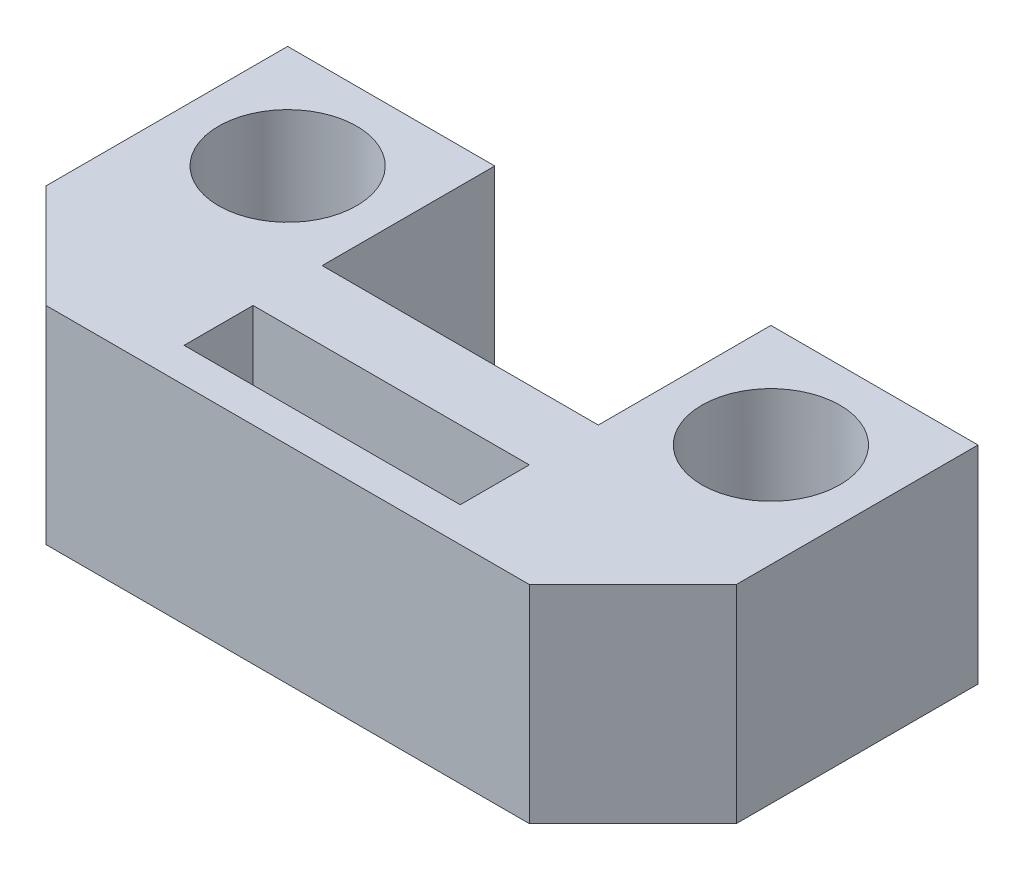
ISO-10303-21;
HEADER;
FILE_DESCRIPTION(('STEP AP214'),'2;1');
FILE_NAME('part.step','',(''),(''),'','','');
FILE_SCHEMA(('AUTOMOTIVE_DESIGN { 1 0 10303 214 1 1 1 1 }'));
ENDSEC;
DATA;
#1=APPLICATION_CONTEXT('core data for automotive mechanical design processes');
#2=APPLICATION_PROTOCOL_DEFINITION('international standard','automotive_design',2000,#1);
#3=PRODUCT_CONTEXT('',#1,'mechanical');
#4=PRODUCT('Part','Part','',(#3));
#5=PRODUCT_RELATED_PRODUCT_CATEGORY('part','',(#4));
#6=PRODUCT_DEFINITION_FORMATION('','',#4);
#7=PRODUCT_DEFINITION_CONTEXT('part definition',#1,'design');
#8=PRODUCT_DEFINITION('design','',#6,#7);
#9=PRODUCT_DEFINITION_SHAPE('','',#8);
#10=(LENGTH_UNIT() NAMED_UNIT(*) SI_UNIT(.MILLI.,.METRE.));
#11=(NAMED_UNIT(*) PLANE_ANGLE_UNIT() SI_UNIT($,.RADIAN.));
#12=(NAMED_UNIT(*) SI_UNIT($,.STERADIAN.) SOLID_ANGLE_UNIT());
#13=UNCERTAINTY_MEASURE_WITH_UNIT(LENGTH_MEASURE(1.E-05),#10,'distance_accuracy_value','');
#14=(GEOMETRIC_REPRESENTATION_CONTEXT(3) GLOBAL_UNCERTAINTY_ASSIGNED_CONTEXT((#13)) GLOBAL_UNIT_ASSIGNED_CONTEXT((#10,
#11,#12)) REPRESENTATION_CONTEXT('',''));
#15=CARTESIAN_POINT('',(0.,0.,0.));
#16=DIRECTION('',(0.,0.,1.));
#17=DIRECTION('',(1.,0.,0.));
#18=AXIS2_PLACEMENT_3D('',#15,#16,#17);
#19=CARTESIAN_POINT('',(-10.,6.,0.));
#20=DIRECTION('',(0.,0.,-1.));
#21=DIRECTION('',(-1.,0.,0.));
#22=AXIS2_PLACEMENT_3D('',#19,#20,#21);
#23=PLANE('',#22);
#24=DIRECTION('',(1.,0.,0.));
#25=VECTOR('',#24,1.);
#26=CARTESIAN_POINT('',(-10.,0.,0.));
#27=LINE('',#26,#25);
#28=CARTESIAN_POINT('',(-7.,0.,0.));
#29=VERTEX_POINT('',#28);
#30=CARTESIAN_POINT('',(6.99999999999999,0.,0.));
#31=VERTEX_POINT('',#30);
#32=EDGE_CURVE('E192',#29,#31,#27,.T.);
#33=ORIENTED_EDGE('',*,*,#32,.T.);
#34=DIRECTION('',(0.,1.,0.));
#35=VECTOR('',#34,1.);
#36=CARTESIAN_POINT('',(6.99999999999999,6.,0.));
#37=LINE('',#36,#35);
#38=CARTESIAN_POINT('',(6.99999999999999,6.,0.));
#39=VERTEX_POINT('',#38);
#40=EDGE_CURVE('E56',#31,#39,#37,.T.);
#41=ORIENTED_EDGE('',*,*,#40,.T.);
#42=DIRECTION('',(1.,0.,0.));
#43=VECTOR('',#42,1.);
#44=CARTESIAN_POINT('',(-10.,6.,0.));
#45=LINE('',#44,#43);
#46=CARTESIAN_POINT('',(-7.,6.,0.));
#47=VERTEX_POINT('',#46);
#48=EDGE_CURVE('E195',#47,#39,#45,.T.);
#49=ORIENTED_EDGE('',*,*,#48,.F.);
#50=DIRECTION('',(0.,-1.,0.));
#51=VECTOR('',#50,1.);
#52=CARTESIAN_POINT('',(-7.,6.,0.));
#53=LINE('',#52,#51);
#54=EDGE_CURVE('E250',#47,#29,#53,.T.);
#55=ORIENTED_EDGE('',*,*,#54,.T.);
#56=EDGE_LOOP('',(#33,#41,#49,#55));
#57=FACE_BOUND('',#56,.T.);
#58=ADVANCED_FACE('F35',(#57),#23,.F.);
#59=CARTESIAN_POINT('',(10.,6.,-10.));
#60=DIRECTION('',(-1.,0.,0.));
#61=DIRECTION('',(0.,0.,1.));
#62=AXIS2_PLACEMENT_3D('',#59,#60,#61);
#63=PLANE('',#62);
#64=DIRECTION('',(0.,0.,-1.));
#65=VECTOR('',#64,1.);
#66=CARTESIAN_POINT('',(10.,6.,0.));
#67=LINE('',#66,#65);
#68=CARTESIAN_POINT('',(10.,6.,-3.));
#69=VERTEX_POINT('',#68);
#70=CARTESIAN_POINT('',(10.,6.,-10.));
#71=VERTEX_POINT('',#70);
#72=EDGE_CURVE('E198',#69,#71,#67,.T.);
#73=ORIENTED_EDGE('',*,*,#72,.F.);
#74=DIRECTION('',(0.,-1.,0.));
#75=VECTOR('',#74,1.);
#76=CARTESIAN_POINT('',(10.,6.,-3.));
#77=LINE('',#76,#75);
#78=CARTESIAN_POINT('',(10.,0.,-3.));
#79=VERTEX_POINT('',#78);
#80=EDGE_CURVE('E243',#69,#79,#77,.T.);
#81=ORIENTED_EDGE('',*,*,#80,.T.);
#82=DIRECTION('',(0.,0.,-1.));
#83=VECTOR('',#82,1.);
#84=CARTESIAN_POINT('',(10.,0.,-10.));
#85=LINE('',#84,#83);
#86=CARTESIAN_POINT('',(10.,0.,-10.));
#87=VERTEX_POINT('',#86);
#88=EDGE_CURVE('E213',#79,#87,#85,.T.);
#89=ORIENTED_EDGE('',*,*,#88,.T.);
#90=DIRECTION('',(0.,-1.,0.));
#91=VECTOR('',#90,1.);
#92=CARTESIAN_POINT('',(10.,6.,-10.));
#93=LINE('',#92,#91);
#94=EDGE_CURVE('E240',#71,#87,#93,.T.);
#95=ORIENTED_EDGE('',*,*,#94,.F.);
#96=EDGE_LOOP('',(#73,#81,#89,#95));
#97=FACE_BOUND('',#96,.T.);
#98=ADVANCED_FACE('F263',(#97),#63,.F.);
#99=CARTESIAN_POINT('',(4.,6.,-10.));
#100=DIRECTION('',(0.,0.,1.));
#101=DIRECTION('',(1.,0.,0.));
#102=AXIS2_PLACEMENT_3D('',#99,#100,#101);
#103=PLANE('',#102);
#104=DIRECTION('',(-1.,0.,0.));
#105=VECTOR('',#104,1.);
#106=CARTESIAN_POINT('',(4.,0.,-10.));
#107=LINE('',#106,#105);
#108=CARTESIAN_POINT('',(4.,0.,-10.));
#109=VERTEX_POINT('',#108);
#110=EDGE_CURVE('E215',#87,#109,#107,.T.);
#111=ORIENTED_EDGE('',*,*,#110,.T.);
#112=DIRECTION('',(0.,-1.,0.));
#113=VECTOR('',#112,1.);
#114=CARTESIAN_POINT('',(4.,6.,-10.));
#115=LINE('',#114,#113);
#116=CARTESIAN_POINT('',(4.,6.,-10.));
#117=VERTEX_POINT('',#116);
#118=EDGE_CURVE('E237',#117,#109,#115,.T.);
#119=ORIENTED_EDGE('',*,*,#118,.F.);
#120=DIRECTION('',(-1.,0.,0.));
#121=VECTOR('',#120,1.);
#122=CARTESIAN_POINT('',(4.,6.,-10.));
#123=LINE('',#122,#121);
#124=EDGE_CURVE('E200',#71,#117,#123,.T.);
#125=ORIENTED_EDGE('',*,*,#124,.F.);
#126=ORIENTED_EDGE('',*,*,#94,.T.);
#127=EDGE_LOOP('',(#111,#119,#125,#126));
#128=FACE_BOUND('',#127,.T.);
#129=ADVANCED_FACE('F297',(#128),#103,.F.);
#130=CARTESIAN_POINT('',(4.,6.,-5.));
#131=DIRECTION('',(1.,0.,0.));
#132=DIRECTION('',(0.,0.,-1.));
#133=AXIS2_PLACEMENT_3D('',#130,#131,#132);
#134=PLANE('',#133);
#135=DIRECTION('',(0.,0.,1.));
#136=VECTOR('',#135,1.);
#137=CARTESIAN_POINT('',(4.,0.,-5.));
#138=LINE('',#137,#136);
#139=CARTESIAN_POINT('',(4.,0.,-5.));
#140=VERTEX_POINT('',#139);
#141=EDGE_CURVE('E217',#109,#140,#138,.T.);
#142=ORIENTED_EDGE('',*,*,#141,.T.);
#143=DIRECTION('',(0.,-1.,0.));
#144=VECTOR('',#143,1.);
#145=CARTESIAN_POINT('',(4.,6.,-5.));
#146=LINE('',#145,#144);
#147=CARTESIAN_POINT('',(4.,6.,-5.));
#148=VERTEX_POINT('',#147);
#149=EDGE_CURVE('E234',#148,#140,#146,.T.);
#150=ORIENTED_EDGE('',*,*,#149,.F.);
#151=DIRECTION('',(0.,0.,1.));
#152=VECTOR('',#151,1.);
#153=CARTESIAN_POINT('',(4.,6.,-5.));
#154=LINE('',#153,#152);
#155=EDGE_CURVE('E202',#117,#148,#154,.T.);
#156=ORIENTED_EDGE('',*,*,#155,.F.);
#157=ORIENTED_EDGE('',*,*,#118,.T.);
#158=EDGE_LOOP('',(#142,#150,#156,#157));
#159=FACE_BOUND('',#158,.T.);
#160=ADVANCED_FACE('F294',(#159),#134,.F.);
#161=CARTESIAN_POINT('',(-4.,6.,-5.));
#162=DIRECTION('',(0.,0.,1.));
#163=DIRECTION('',(1.,0.,0.));
#164=AXIS2_PLACEMENT_3D('',#161,#162,#163);
#165=PLANE('',#164);
#166=DIRECTION('',(-1.,0.,0.));
#167=VECTOR('',#166,1.);
#168=CARTESIAN_POINT('',(-4.,0.,-5.));
#169=LINE('',#168,#167);
#170=CARTESIAN_POINT('',(-4.,0.,-5.));
#171=VERTEX_POINT('',#170);
#172=EDGE_CURVE('E219',#140,#171,#169,.T.);
#173=ORIENTED_EDGE('',*,*,#172,.T.);
#174=DIRECTION('',(0.,-1.,0.));
#175=VECTOR('',#174,1.);
#176=CARTESIAN_POINT('',(-4.,6.,-5.));
#177=LINE('',#176,#175);
#178=CARTESIAN_POINT('',(-4.,6.,-5.));
#179=VERTEX_POINT('',#178);
#180=EDGE_CURVE('E231',#179,#171,#177,.T.);
#181=ORIENTED_EDGE('',*,*,#180,.F.);
#182=DIRECTION('',(-1.,0.,0.));
#183=VECTOR('',#182,1.);
#184=CARTESIAN_POINT('',(-4.,6.,-5.));
#185=LINE('',#184,#183);
#186=EDGE_CURVE('E204',#148,#179,#185,.T.);
#187=ORIENTED_EDGE('',*,*,#186,.F.);
#188=ORIENTED_EDGE('',*,*,#149,.T.);
#189=EDGE_LOOP('',(#173,#181,#187,#188));
#190=FACE_BOUND('',#189,.T.);
#191=ADVANCED_FACE('F290',(#190),#165,.F.);
#192=CARTESIAN_POINT('',(-4.,6.,-5.));
#193=DIRECTION('',(-1.,0.,0.));
#194=DIRECTION('',(0.,0.,1.));
#195=AXIS2_PLACEMENT_3D('',#192,#193,#194);
#196=PLANE('',#195);
#197=DIRECTION('',(0.,0.,-1.));
#198=VECTOR('',#197,1.);
#199=CARTESIAN_POINT('',(-4.,0.,-5.));
#200=LINE('',#199,#198);
#201=CARTESIAN_POINT('',(-4.,0.,-10.));
#202=VERTEX_POINT('',#201);
#203=EDGE_CURVE('E221',#171,#202,#200,.T.);
#204=ORIENTED_EDGE('',*,*,#203,.T.);
#205=DIRECTION('',(0.,-1.,0.));
#206=VECTOR('',#205,1.);
#207=CARTESIAN_POINT('',(-4.,6.,-10.));
#208=LINE('',#207,#206);
#209=CARTESIAN_POINT('',(-4.,6.,-10.));
#210=VERTEX_POINT('',#209);
#211=EDGE_CURVE('E228',#210,#202,#208,.T.);
#212=ORIENTED_EDGE('',*,*,#211,.F.);
#213=DIRECTION('',(0.,0.,-1.));
#214=VECTOR('',#213,1.);
#215=CARTESIAN_POINT('',(-4.,6.,-5.));
#216=LINE('',#215,#214);
#217=EDGE_CURVE('E206',#179,#210,#216,.T.);
#218=ORIENTED_EDGE('',*,*,#217,.F.);
#219=ORIENTED_EDGE('',*,*,#180,.T.);
#220=EDGE_LOOP('',(#204,#212,#218,#219));
#221=FACE_BOUND('',#220,.T.);
#222=ADVANCED_FACE('F285',(#221),#196,.F.);
#223=CARTESIAN_POINT('',(-4.,6.,-10.));
#224=DIRECTION('',(0.,0.,1.));
#225=DIRECTION('',(1.,0.,0.));
#226=AXIS2_PLACEMENT_3D('',#223,#224,#225);
#227=PLANE('',#226);
#228=DIRECTION('',(-1.,0.,0.));
#229=VECTOR('',#228,1.);
#230=CARTESIAN_POINT('',(-4.,0.,-10.));
#231=LINE('',#230,#229);
#232=CARTESIAN_POINT('',(-10.,0.,-10.));
#233=VERTEX_POINT('',#232);
#234=EDGE_CURVE('E223',#202,#233,#231,.T.);
#235=ORIENTED_EDGE('',*,*,#234,.T.);
#236=DIRECTION('',(0.,-1.,0.));
#237=VECTOR('',#236,1.);
#238=CARTESIAN_POINT('',(-10.,6.,-10.));
#239=LINE('',#238,#237);
#240=CARTESIAN_POINT('',(-10.,6.,-10.));
#241=VERTEX_POINT('',#240);
#242=EDGE_CURVE('E211',#241,#233,#239,.T.);
#243=ORIENTED_EDGE('',*,*,#242,.F.);
#244=DIRECTION('',(-1.,0.,0.));
#245=VECTOR('',#244,1.);
#246=CARTESIAN_POINT('',(-4.,6.,-10.));
#247=LINE('',#246,#245);
#248=EDGE_CURVE('E208',#210,#241,#247,.T.);
#249=ORIENTED_EDGE('',*,*,#248,.F.);
#250=ORIENTED_EDGE('',*,*,#211,.T.);
#251=EDGE_LOOP('',(#235,#243,#249,#250));
#252=FACE_BOUND('',#251,.T.);
#253=ADVANCED_FACE('F279',(#252),#227,.F.);
#254=CARTESIAN_POINT('',(-10.,6.,-10.));
#255=DIRECTION('',(1.,0.,0.));
#256=DIRECTION('',(0.,0.,-1.));
#257=AXIS2_PLACEMENT_3D('',#254,#255,#256);
#258=PLANE('',#257);
#259=DIRECTION('',(0.,0.,1.));
#260=VECTOR('',#259,1.);
#261=CARTESIAN_POINT('',(-10.,0.,-10.));
#262=LINE('',#261,#260);
#263=CARTESIAN_POINT('',(-10.,0.,-3.00000000000001));
#264=VERTEX_POINT('',#263);
#265=EDGE_CURVE('E196',#233,#264,#262,.T.);
#266=ORIENTED_EDGE('',*,*,#265,.T.);
#267=DIRECTION('',(0.,1.,0.));
#268=VECTOR('',#267,1.);
#269=CARTESIAN_POINT('',(-10.,6.,-3.00000000000001));
#270=LINE('',#269,#268);
#271=CARTESIAN_POINT('',(-10.,6.,-3.00000000000001));
#272=VERTEX_POINT('',#271);
#273=EDGE_CURVE('E11',#264,#272,#270,.T.);
#274=ORIENTED_EDGE('',*,*,#273,.T.);
#275=DIRECTION('',(0.,0.,1.));
#276=VECTOR('',#275,1.);
#277=CARTESIAN_POINT('',(-10.,6.,0.));
#278=LINE('',#277,#276);
#279=EDGE_CURVE('E193',#241,#272,#278,.T.);
#280=ORIENTED_EDGE('',*,*,#279,.F.);
#281=ORIENTED_EDGE('',*,*,#242,.T.);
#282=EDGE_LOOP('',(#266,#274,#280,#281));
#283=FACE_BOUND('',#282,.T.);
#284=ADVANCED_FACE('F275',(#283),#258,.F.);
#285=CARTESIAN_POINT('',(0.,6.,0.));
#286=DIRECTION('',(0.,1.,0.));
#287=DIRECTION('',(0.,0.,1.));
#288=AXIS2_PLACEMENT_3D('',#285,#286,#287);
#289=PLANE('',#288);
#290=DIRECTION('',(0.,0.,1.));
#291=VECTOR('',#290,1.);
#292=CARTESIAN_POINT('',(-4.,6.,-3.));
#293=LINE('',#292,#291);
#294=CARTESIAN_POINT('',(-4.,6.,-3.));
#295=VERTEX_POINT('',#294);
#296=CARTESIAN_POINT('',(-4.,6.,-0.999999999999999));
#297=VERTEX_POINT('',#296);
#298=EDGE_CURVE('E144',#295,#297,#293,.T.);
#299=ORIENTED_EDGE('',*,*,#298,.F.);
#300=DIRECTION('',(-1.,0.,0.));
#301=VECTOR('',#300,1.);
#302=CARTESIAN_POINT('',(-4.,6.,-3.));
#303=LINE('',#302,#301);
#304=CARTESIAN_POINT('',(4.,6.,-3.));
#305=VERTEX_POINT('',#304);
#306=EDGE_CURVE('E149',#305,#295,#303,.T.);
#307=ORIENTED_EDGE('',*,*,#306,.F.);
#308=DIRECTION('',(0.,0.,-1.));
#309=VECTOR('',#308,1.);
#310=CARTESIAN_POINT('',(4.,6.,-3.));
#311=LINE('',#310,#309);
#312=CARTESIAN_POINT('',(4.,6.,-0.999999999999999));
#313=VERTEX_POINT('',#312);
#314=EDGE_CURVE('E172',#313,#305,#311,.T.);
#315=ORIENTED_EDGE('',*,*,#314,.F.);
#316=DIRECTION('',(1.,0.,0.));
#317=VECTOR('',#316,1.);
#318=CARTESIAN_POINT('',(-4.,6.,-0.999999999999999));
#319=LINE('',#318,#317);
#320=EDGE_CURVE('E165',#297,#313,#319,.T.);
#321=ORIENTED_EDGE('',*,*,#320,.F.);
#322=EDGE_LOOP('',(#299,#307,#315,#321));
#323=FACE_BOUND('',#322,.T.);
#324=CARTESIAN_POINT('',(7.,6.,-7.));
#325=DIRECTION('',(0.,1.,0.));
#326=DIRECTION('',(0.,0.,-1.));
#327=AXIS2_PLACEMENT_3D('',#324,#325,#326);
#328=CIRCLE('',#327,2.);
#329=CARTESIAN_POINT('',(7.,6.,-9.));
#330=VERTEX_POINT('',#329);
#331=EDGE_CURVE('E157',#330,#330,#328,.T.);
#332=ORIENTED_EDGE('',*,*,#331,.F.);
#333=EDGE_LOOP('',(#332));
#334=FACE_BOUND('',#333,.T.);
#335=CARTESIAN_POINT('',(-7.,6.,-7.));
#336=DIRECTION('',(0.,1.,0.));
#337=DIRECTION('',(0.,0.,1.));
#338=AXIS2_PLACEMENT_3D('',#335,#336,#337);
#339=CIRCLE('',#338,2.);
#340=CARTESIAN_POINT('',(-7.,6.,-5.));
#341=VERTEX_POINT('',#340);
#342=EDGE_CURVE('E186',#341,#341,#339,.T.);
#343=ORIENTED_EDGE('',*,*,#342,.F.);
#344=EDGE_LOOP('',(#343));
#345=FACE_BOUND('',#344,.T.);
#346=ORIENTED_EDGE('',*,*,#48,.T.);
#347=DIRECTION('',(-0.707106781186549,0.,0.707106781186546));
#348=VECTOR('',#347,1.);
#349=CARTESIAN_POINT('',(3.49999999999998,6.,3.49999999999999));
#350=LINE('',#349,#348);
#351=EDGE_CURVE('E43',#39,#69,#350,.F.);
#352=ORIENTED_EDGE('',*,*,#351,.T.);
#353=ORIENTED_EDGE('',*,*,#72,.T.);
#354=ORIENTED_EDGE('',*,*,#124,.T.);
#355=ORIENTED_EDGE('',*,*,#155,.T.);
#356=ORIENTED_EDGE('',*,*,#186,.T.);
#357=ORIENTED_EDGE('',*,*,#217,.T.);
#358=ORIENTED_EDGE('',*,*,#248,.T.);
#359=ORIENTED_EDGE('',*,*,#279,.T.);
#360=DIRECTION('',(-0.707106781186546,0.,-0.707106781186549));
#361=VECTOR('',#360,1.);
#362=CARTESIAN_POINT('',(-3.50000000000001,6.,3.5));
#363=LINE('',#362,#361);
#364=EDGE_CURVE('E254',#272,#47,#363,.F.);
#365=ORIENTED_EDGE('',*,*,#364,.T.);
#366=EDGE_LOOP('',(#346,#352,#353,#354,#355,#356,#357,#358,#359,#365));
#367=FACE_BOUND('',#366,.T.);
#368=ADVANCED_FACE('F258',(#323,#334,#345,#367),#289,.T.);
#369=CARTESIAN_POINT('',(0.,0.,0.));
#370=DIRECTION('',(0.,1.,0.));
#371=DIRECTION('',(0.,0.,1.));
#372=AXIS2_PLACEMENT_3D('',#369,#370,#371);
#373=PLANE('',#372);
#374=DIRECTION('',(1.,0.,0.));
#375=VECTOR('',#374,1.);
#376=CARTESIAN_POINT('',(-4.,0.,-3.));
#377=LINE('',#376,#375);
#378=CARTESIAN_POINT('',(-4.,0.,-3.));
#379=VERTEX_POINT('',#378);
#380=CARTESIAN_POINT('',(4.,0.,-3.));
#381=VERTEX_POINT('',#380);
#382=EDGE_CURVE('E163',#379,#381,#377,.T.);
#383=ORIENTED_EDGE('',*,*,#382,.F.);
#384=DIRECTION('',(0.,0.,-1.));
#385=VECTOR('',#384,1.);
#386=CARTESIAN_POINT('',(-4.,0.,-3.));
#387=LINE('',#386,#385);
#388=CARTESIAN_POINT('',(-4.,0.,-0.999999999999999));
#389=VERTEX_POINT('',#388);
#390=EDGE_CURVE('E141',#389,#379,#387,.T.);
#391=ORIENTED_EDGE('',*,*,#390,.F.);
#392=DIRECTION('',(-1.,0.,0.));
#393=VECTOR('',#392,1.);
#394=CARTESIAN_POINT('',(-4.,0.,-0.999999999999999));
#395=LINE('',#394,#393);
#396=CARTESIAN_POINT('',(4.,0.,-0.999999999999999));
#397=VERTEX_POINT('',#396);
#398=EDGE_CURVE('E153',#397,#389,#395,.T.);
#399=ORIENTED_EDGE('',*,*,#398,.F.);
#400=DIRECTION('',(0.,0.,1.));
#401=VECTOR('',#400,1.);
#402=CARTESIAN_POINT('',(4.,0.,-3.));
#403=LINE('',#402,#401);
#404=EDGE_CURVE('E167',#381,#397,#403,.T.);
#405=ORIENTED_EDGE('',*,*,#404,.F.);
#406=EDGE_LOOP('',(#383,#391,#399,#405));
#407=FACE_BOUND('',#406,.T.);
#408=CARTESIAN_POINT('',(7.,0.,-7.));
#409=DIRECTION('',(0.,1.,0.));
#410=DIRECTION('',(0.,0.,1.));
#411=AXIS2_PLACEMENT_3D('',#408,#409,#410);
#412=CIRCLE('',#411,2.);
#413=CARTESIAN_POINT('',(7.,0.,-5.));
#414=VERTEX_POINT('',#413);
#415=EDGE_CURVE('E183',#414,#414,#412,.F.);
#416=ORIENTED_EDGE('',*,*,#415,.F.);
#417=EDGE_LOOP('',(#416));
#418=FACE_BOUND('',#417,.T.);
#419=CARTESIAN_POINT('',(-7.,0.,-7.));
#420=DIRECTION('',(0.,1.,0.));
#421=DIRECTION('',(0.,0.,1.));
#422=AXIS2_PLACEMENT_3D('',#419,#420,#421);
#423=CIRCLE('',#422,2.);
#424=CARTESIAN_POINT('',(-7.,0.,-5.));
#425=VERTEX_POINT('',#424);
#426=EDGE_CURVE('E189',#425,#425,#423,.F.);
#427=ORIENTED_EDGE('',*,*,#426,.F.);
#428=EDGE_LOOP('',(#427));
#429=FACE_BOUND('',#428,.T.);
#430=ORIENTED_EDGE('',*,*,#88,.F.);
#431=DIRECTION('',(0.707106781186549,0.,-0.707106781186546));
#432=VECTOR('',#431,1.);
#433=CARTESIAN_POINT('',(10.,0.,-3.));
#434=LINE('',#433,#432);
#435=EDGE_CURVE('E248',#79,#31,#434,.F.);
#436=ORIENTED_EDGE('',*,*,#435,.T.);
#437=ORIENTED_EDGE('',*,*,#32,.F.);
#438=DIRECTION('',(0.707106781186546,0.,0.707106781186549));
#439=VECTOR('',#438,1.);
#440=CARTESIAN_POINT('',(-7.,0.,0.));
#441=LINE('',#440,#439);
#442=EDGE_CURVE('E246',#29,#264,#441,.F.);
#443=ORIENTED_EDGE('',*,*,#442,.T.);
#444=ORIENTED_EDGE('',*,*,#265,.F.);
#445=ORIENTED_EDGE('',*,*,#234,.F.);
#446=ORIENTED_EDGE('',*,*,#203,.F.);
#447=ORIENTED_EDGE('',*,*,#172,.F.);
#448=ORIENTED_EDGE('',*,*,#141,.F.);
#449=ORIENTED_EDGE('',*,*,#110,.F.);
#450=EDGE_LOOP('',(#430,#436,#437,#443,#444,#445,#446,#447,#448,#449));
#451=FACE_BOUND('',#450,.T.);
#452=ADVANCED_FACE('F160',(#407,#418,#429,#451),#373,.F.);
#453=CARTESIAN_POINT('',(-7.,-0.00100000000000013,-7.));
#454=DIRECTION('',(0.,1.,0.));
#455=DIRECTION('',(0.,0.,1.));
#456=AXIS2_PLACEMENT_3D('',#453,#454,#455);
#457=CYLINDRICAL_SURFACE('',#456,2.);
#458=ORIENTED_EDGE('',*,*,#342,.T.);
#459=EDGE_LOOP('',(#458));
#460=FACE_BOUND('',#459,.T.);
#461=ORIENTED_EDGE('',*,*,#426,.T.);
#462=EDGE_LOOP('',(#461));
#463=FACE_BOUND('',#462,.T.);
#464=ADVANCED_FACE('F331',(#460,#463),#457,.F.);
#465=CARTESIAN_POINT('',(7.,-0.00100000000000013,-7.));
#466=DIRECTION('',(0.,1.,0.));
#467=DIRECTION('',(0.,0.,1.));
#468=AXIS2_PLACEMENT_3D('',#465,#466,#467);
#469=CYLINDRICAL_SURFACE('',#468,2.);
#470=ORIENTED_EDGE('',*,*,#331,.T.);
#471=EDGE_LOOP('',(#470));
#472=FACE_BOUND('',#471,.T.);
#473=ORIENTED_EDGE('',*,*,#415,.T.);
#474=EDGE_LOOP('',(#473));
#475=FACE_BOUND('',#474,.T.);
#476=ADVANCED_FACE('F328',(#472,#475),#469,.F.);
#477=CARTESIAN_POINT('',(-4.,-0.00100000000000013,-3.));
#478=DIRECTION('',(-1.,0.,0.));
#479=DIRECTION('',(0.,0.,1.));
#480=AXIS2_PLACEMENT_3D('',#477,#478,#479);
#481=PLANE('',#480);
#482=ORIENTED_EDGE('',*,*,#390,.T.);
#483=DIRECTION('',(0.,1.,0.));
#484=VECTOR('',#483,1.);
#485=CARTESIAN_POINT('',(-4.,-0.00100000000000013,-3.));
#486=LINE('',#485,#484);
#487=EDGE_CURVE('E158',#379,#295,#486,.T.);
#488=ORIENTED_EDGE('',*,*,#487,.T.);
#489=ORIENTED_EDGE('',*,*,#298,.T.);
#490=DIRECTION('',(0.,1.,0.));
#491=VECTOR('',#490,1.);
#492=CARTESIAN_POINT('',(-4.,-0.00100000000000013,-0.999999999999999));
#493=LINE('',#492,#491);
#494=EDGE_CURVE('E137',#389,#297,#493,.T.);
#495=ORIENTED_EDGE('',*,*,#494,.F.);
#496=EDGE_LOOP('',(#482,#488,#489,#495));
#497=FACE_BOUND('',#496,.T.);
#498=ADVANCED_FACE('F139',(#497),#481,.F.);
#499=CARTESIAN_POINT('',(-4.,-0.00100000000000013,-3.));
#500=DIRECTION('',(0.,0.,-1.));
#501=DIRECTION('',(-1.,0.,0.));
#502=AXIS2_PLACEMENT_3D('',#499,#500,#501);
#503=PLANE('',#502);
#504=ORIENTED_EDGE('',*,*,#382,.T.);
#505=DIRECTION('',(0.,1.,0.));
#506=VECTOR('',#505,1.);
#507=CARTESIAN_POINT('',(4.,-0.00100000000000013,-3.));
#508=LINE('',#507,#506);
#509=EDGE_CURVE('E178',#381,#305,#508,.T.);
#510=ORIENTED_EDGE('',*,*,#509,.T.);
#511=ORIENTED_EDGE('',*,*,#306,.T.);
#512=ORIENTED_EDGE('',*,*,#487,.F.);
#513=EDGE_LOOP('',(#504,#510,#511,#512));
#514=FACE_BOUND('',#513,.T.);
#515=ADVANCED_FACE('F321',(#514),#503,.F.);
#516=CARTESIAN_POINT('',(4.,-0.00100000000000013,-3.));
#517=DIRECTION('',(1.,0.,0.));
#518=DIRECTION('',(0.,0.,-1.));
#519=AXIS2_PLACEMENT_3D('',#516,#517,#518);
#520=PLANE('',#519);
#521=ORIENTED_EDGE('',*,*,#404,.T.);
#522=DIRECTION('',(0.,1.,0.));
#523=VECTOR('',#522,1.);
#524=CARTESIAN_POINT('',(4.,-0.00100000000000013,-0.999999999999999));
#525=LINE('',#524,#523);
#526=EDGE_CURVE('E148',#397,#313,#525,.T.);
#527=ORIENTED_EDGE('',*,*,#526,.T.);
#528=ORIENTED_EDGE('',*,*,#314,.T.);
#529=ORIENTED_EDGE('',*,*,#509,.F.);
#530=EDGE_LOOP('',(#521,#527,#528,#529));
#531=FACE_BOUND('',#530,.T.);
#532=ADVANCED_FACE('F317',(#531),#520,.F.);
#533=CARTESIAN_POINT('',(-4.,-0.00100000000000013,-0.999999999999999));
#534=DIRECTION('',(0.,0.,1.));
#535=DIRECTION('',(1.,0.,0.));
#536=AXIS2_PLACEMENT_3D('',#533,#534,#535);
#537=PLANE('',#536);
#538=ORIENTED_EDGE('',*,*,#398,.T.);
#539=ORIENTED_EDGE('',*,*,#494,.T.);
#540=ORIENTED_EDGE('',*,*,#320,.T.);
#541=ORIENTED_EDGE('',*,*,#526,.F.);
#542=EDGE_LOOP('',(#538,#539,#540,#541));
#543=FACE_BOUND('',#542,.T.);
#544=ADVANCED_FACE('F154',(#543),#537,.F.);
#545=CARTESIAN_POINT('',(10.,6.,-3.));
#546=DIRECTION('',(-0.707106781186546,0.,-0.707106781186549));
#547=DIRECTION('',(0.,-1.,0.));
#548=AXIS2_PLACEMENT_3D('',#545,#546,#547);
#549=PLANE('',#548);
#550=ORIENTED_EDGE('',*,*,#351,.F.);
#551=ORIENTED_EDGE('',*,*,#40,.F.);
#552=ORIENTED_EDGE('',*,*,#435,.F.);
#553=ORIENTED_EDGE('',*,*,#80,.F.);
#554=EDGE_LOOP('',(#550,#551,#552,#553));
#555=FACE_BOUND('',#554,.T.);
#556=ADVANCED_FACE('F266',(#555),#549,.F.);
#557=CARTESIAN_POINT('',(-7.,6.,0.));
#558=DIRECTION('',(0.707106781186549,0.,-0.707106781186546));
#559=DIRECTION('',(0.,-1.,0.));
#560=AXIS2_PLACEMENT_3D('',#557,#558,#559);
#561=PLANE('',#560);
#562=ORIENTED_EDGE('',*,*,#364,.F.);
#563=ORIENTED_EDGE('',*,*,#273,.F.);
#564=ORIENTED_EDGE('',*,*,#442,.F.);
#565=ORIENTED_EDGE('',*,*,#54,.F.);
#566=EDGE_LOOP('',(#562,#563,#564,#565));
#567=FACE_BOUND('',#566,.T.);
#568=ADVANCED_FACE('F37',(#567),#561,.F.);
#569=CLOSED_SHELL('',(#58,#98,#129,#160,#191,#222,#253,#284,#368,#452,#464,#476,#498,#515,#532,
#544,#556,#568));
#570=MANIFOLD_SOLID_BREP('B2',#569);
#571=ADVANCED_BREP_SHAPE_REPRESENTATION('',(#18,#570),#14);
#572=SHAPE_DEFINITION_REPRESENTATION(#9,#571);
ENDSEC;
END-ISO-10303-21;
